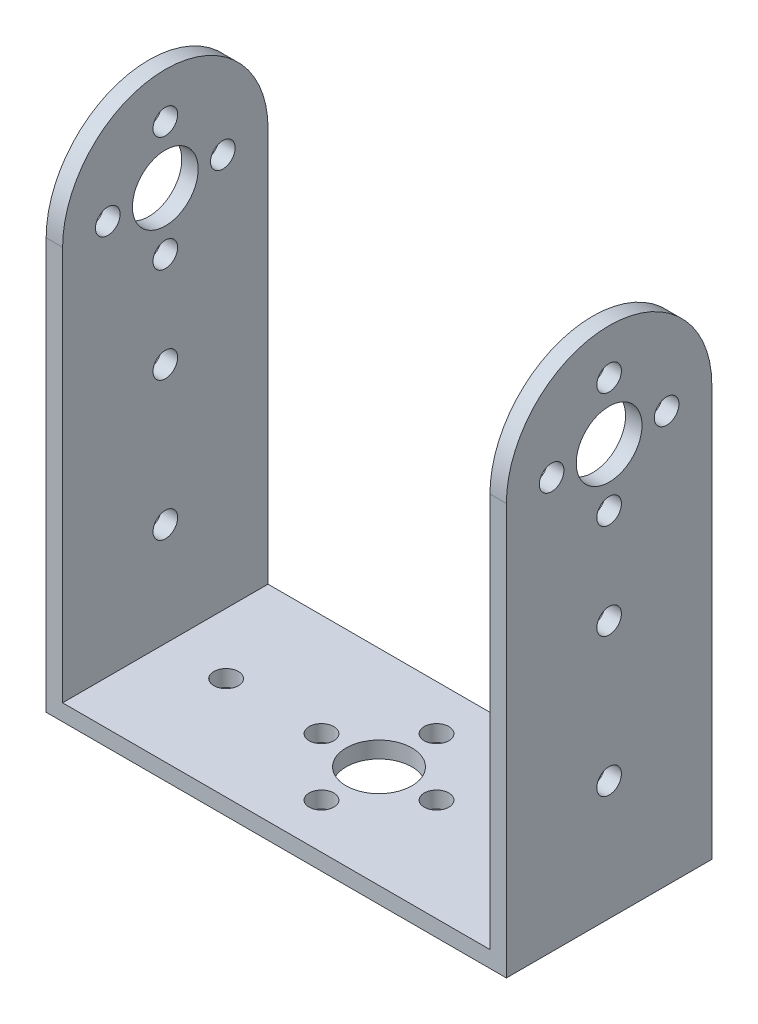
ISO-10303-21;
HEADER;
FILE_DESCRIPTION(('STEP AP214'),'2;1');
FILE_NAME('part.step','',(''),(''),'','','');
FILE_SCHEMA(('AUTOMOTIVE_DESIGN { 1 0 10303 214 1 1 1 1 }'));
ENDSEC;
DATA;
#1=APPLICATION_CONTEXT('core data for automotive mechanical design processes');
#2=APPLICATION_PROTOCOL_DEFINITION('international standard','automotive_design',2000,#1);
#3=PRODUCT_CONTEXT('',#1,'mechanical');
#4=PRODUCT('Part','Part','',(#3));
#5=PRODUCT_RELATED_PRODUCT_CATEGORY('part','',(#4));
#6=PRODUCT_DEFINITION_FORMATION('','',#4);
#7=PRODUCT_DEFINITION_CONTEXT('part definition',#1,'design');
#8=PRODUCT_DEFINITION('design','',#6,#7);
#9=PRODUCT_DEFINITION_SHAPE('','',#8);
#10=(LENGTH_UNIT() NAMED_UNIT(*) SI_UNIT(.MILLI.,.METRE.));
#11=(NAMED_UNIT(*) PLANE_ANGLE_UNIT() SI_UNIT($,.RADIAN.));
#12=(NAMED_UNIT(*) SI_UNIT($,.STERADIAN.) SOLID_ANGLE_UNIT());
#13=UNCERTAINTY_MEASURE_WITH_UNIT(LENGTH_MEASURE(1.E-05),#10,'distance_accuracy_value','');
#14=(GEOMETRIC_REPRESENTATION_CONTEXT(3) GLOBAL_UNCERTAINTY_ASSIGNED_CONTEXT((#13)) GLOBAL_UNIT_ASSIGNED_CONTEXT((#10,
#11,#12)) REPRESENTATION_CONTEXT('',''));
#15=CARTESIAN_POINT('',(0.,0.,0.));
#16=DIRECTION('',(0.,0.,1.));
#17=DIRECTION('',(1.,0.,0.));
#18=AXIS2_PLACEMENT_3D('',#15,#16,#17);
#19=CARTESIAN_POINT('',(0.,2.,0.));
#20=DIRECTION('',(0.,1.,0.));
#21=DIRECTION('',(0.,0.,1.));
#22=AXIS2_PLACEMENT_3D('',#19,#20,#21);
#23=PLANE('',#22);
#24=CARTESIAN_POINT('',(18.6,2.,0.));
#25=DIRECTION('',(0.,1.,0.));
#26=DIRECTION('',(0.,0.,1.));
#27=AXIS2_PLACEMENT_3D('',#24,#25,#26);
#28=CIRCLE('',#27,1.5);
#29=CARTESIAN_POINT('',(18.6,2.,1.5));
#30=VERTEX_POINT('',#29);
#31=EDGE_CURVE('E221',#30,#30,#28,.T.);
#32=ORIENTED_EDGE('',*,*,#31,.F.);
#33=EDGE_LOOP('',(#32));
#34=FACE_BOUND('',#33,.T.);
#35=CARTESIAN_POINT('',(0.,2.,7.));
#36=DIRECTION('',(0.,1.,0.));
#37=DIRECTION('',(0.,0.,1.));
#38=AXIS2_PLACEMENT_3D('',#35,#36,#37);
#39=CIRCLE('',#38,1.5);
#40=CARTESIAN_POINT('',(0.,2.,8.5));
#41=VERTEX_POINT('',#40);
#42=EDGE_CURVE('E233',#41,#41,#39,.T.);
#43=ORIENTED_EDGE('',*,*,#42,.F.);
#44=EDGE_LOOP('',(#43));
#45=FACE_BOUND('',#44,.T.);
#46=CARTESIAN_POINT('',(0.,2.,-7.));
#47=DIRECTION('',(0.,1.,0.));
#48=DIRECTION('',(0.,0.,1.));
#49=AXIS2_PLACEMENT_3D('',#46,#47,#48);
#50=CIRCLE('',#49,1.5);
#51=CARTESIAN_POINT('',(0.,2.,-5.5));
#52=VERTEX_POINT('',#51);
#53=EDGE_CURVE('E245',#52,#52,#50,.T.);
#54=ORIENTED_EDGE('',*,*,#53,.F.);
#55=EDGE_LOOP('',(#54));
#56=FACE_BOUND('',#55,.T.);
#57=DIRECTION('',(0.,0.,1.));
#58=VECTOR('',#57,1.);
#59=CARTESIAN_POINT('',(-26.,2.,12.5));
#60=LINE('',#59,#58);
#61=CARTESIAN_POINT('',(-26.,2.,-12.5));
#62=VERTEX_POINT('',#61);
#63=CARTESIAN_POINT('',(-26.,2.,12.5));
#64=VERTEX_POINT('',#63);
#65=EDGE_CURVE('E38',#62,#64,#60,.T.);
#66=ORIENTED_EDGE('',*,*,#65,.T.);
#67=DIRECTION('',(1.,0.,0.));
#68=VECTOR('',#67,1.);
#69=CARTESIAN_POINT('',(26.,2.,12.5));
#70=LINE('',#69,#68);
#71=CARTESIAN_POINT('',(26.,2.,12.5));
#72=VERTEX_POINT('',#71);
#73=EDGE_CURVE('E260',#64,#72,#70,.T.);
#74=ORIENTED_EDGE('',*,*,#73,.T.);
#75=DIRECTION('',(0.,0.,-1.));
#76=VECTOR('',#75,1.);
#77=CARTESIAN_POINT('',(26.,2.,12.5));
#78=LINE('',#77,#76);
#79=CARTESIAN_POINT('',(26.,2.,-12.5));
#80=VERTEX_POINT('',#79);
#81=EDGE_CURVE('E44',#72,#80,#78,.T.);
#82=ORIENTED_EDGE('',*,*,#81,.T.);
#83=DIRECTION('',(-1.,0.,0.));
#84=VECTOR('',#83,1.);
#85=CARTESIAN_POINT('',(26.,2.,-12.5));
#86=LINE('',#85,#84);
#87=EDGE_CURVE('E11',#80,#62,#86,.T.);
#88=ORIENTED_EDGE('',*,*,#87,.T.);
#89=EDGE_LOOP('',(#66,#74,#82,#88));
#90=FACE_BOUND('',#89,.T.);
#91=CARTESIAN_POINT('',(0.,2.,0.));
#92=DIRECTION('',(0.,1.,0.));
#93=DIRECTION('',(0.,0.,1.));
#94=AXIS2_PLACEMENT_3D('',#91,#92,#93);
#95=CIRCLE('',#94,4.);
#96=CARTESIAN_POINT('',(0.,2.,4.));
#97=VERTEX_POINT('',#96);
#98=EDGE_CURVE('E251',#97,#97,#95,.T.);
#99=ORIENTED_EDGE('',*,*,#98,.F.);
#100=EDGE_LOOP('',(#99));
#101=FACE_BOUND('',#100,.T.);
#102=CARTESIAN_POINT('',(7.,2.,0.));
#103=DIRECTION('',(0.,1.,0.));
#104=DIRECTION('',(0.,0.,1.));
#105=AXIS2_PLACEMENT_3D('',#102,#103,#104);
#106=CIRCLE('',#105,1.5);
#107=CARTESIAN_POINT('',(7.,2.,1.5));
#108=VERTEX_POINT('',#107);
#109=EDGE_CURVE('E239',#108,#108,#106,.T.);
#110=ORIENTED_EDGE('',*,*,#109,.F.);
#111=EDGE_LOOP('',(#110));
#112=FACE_BOUND('',#111,.T.);
#113=CARTESIAN_POINT('',(-7.,2.,0.));
#114=DIRECTION('',(0.,1.,0.));
#115=DIRECTION('',(0.,0.,1.));
#116=AXIS2_PLACEMENT_3D('',#113,#114,#115);
#117=CIRCLE('',#116,1.5);
#118=CARTESIAN_POINT('',(-7.,2.,1.5));
#119=VERTEX_POINT('',#118);
#120=EDGE_CURVE('E227',#119,#119,#117,.T.);
#121=ORIENTED_EDGE('',*,*,#120,.F.);
#122=EDGE_LOOP('',(#121));
#123=FACE_BOUND('',#122,.T.);
#124=CARTESIAN_POINT('',(-18.6,2.,0.));
#125=DIRECTION('',(0.,1.,0.));
#126=DIRECTION('',(0.,0.,1.));
#127=AXIS2_PLACEMENT_3D('',#124,#125,#126);
#128=CIRCLE('',#127,1.5);
#129=CARTESIAN_POINT('',(-18.6,2.,1.5));
#130=VERTEX_POINT('',#129);
#131=EDGE_CURVE('E214',#130,#130,#128,.T.);
#132=ORIENTED_EDGE('',*,*,#131,.F.);
#133=EDGE_LOOP('',(#132));
#134=FACE_BOUND('',#133,.T.);
#135=ADVANCED_FACE('F34',(#34,#45,#56,#90,#101,#112,#123,#134),#23,.T.);
#136=CARTESIAN_POINT('',(0.,0.,0.));
#137=DIRECTION('',(0.,1.,0.));
#138=DIRECTION('',(0.,0.,1.));
#139=AXIS2_PLACEMENT_3D('',#136,#137,#138);
#140=PLANE('',#139);
#141=CARTESIAN_POINT('',(18.6,0.,0.));
#142=DIRECTION('',(0.,1.,0.));
#143=DIRECTION('',(0.,0.,1.));
#144=AXIS2_PLACEMENT_3D('',#141,#142,#143);
#145=CIRCLE('',#144,1.5);
#146=CARTESIAN_POINT('',(18.6,0.,1.5));
#147=VERTEX_POINT('',#146);
#148=EDGE_CURVE('E217',#147,#147,#145,.T.);
#149=ORIENTED_EDGE('',*,*,#148,.T.);
#150=EDGE_LOOP('',(#149));
#151=FACE_BOUND('',#150,.T.);
#152=CARTESIAN_POINT('',(0.,0.,7.));
#153=DIRECTION('',(0.,1.,0.));
#154=DIRECTION('',(0.,0.,1.));
#155=AXIS2_PLACEMENT_3D('',#152,#153,#154);
#156=CIRCLE('',#155,1.5);
#157=CARTESIAN_POINT('',(0.,0.,8.5));
#158=VERTEX_POINT('',#157);
#159=EDGE_CURVE('E230',#158,#158,#156,.T.);
#160=ORIENTED_EDGE('',*,*,#159,.T.);
#161=EDGE_LOOP('',(#160));
#162=FACE_BOUND('',#161,.T.);
#163=CARTESIAN_POINT('',(0.,0.,-7.));
#164=DIRECTION('',(0.,1.,0.));
#165=DIRECTION('',(0.,0.,1.));
#166=AXIS2_PLACEMENT_3D('',#163,#164,#165);
#167=CIRCLE('',#166,1.5);
#168=CARTESIAN_POINT('',(0.,0.,-5.5));
#169=VERTEX_POINT('',#168);
#170=EDGE_CURVE('E242',#169,#169,#167,.T.);
#171=ORIENTED_EDGE('',*,*,#170,.T.);
#172=EDGE_LOOP('',(#171));
#173=FACE_BOUND('',#172,.T.);
#174=DIRECTION('',(1.,0.,0.));
#175=VECTOR('',#174,1.);
#176=CARTESIAN_POINT('',(26.,0.,12.5));
#177=LINE('',#176,#175);
#178=CARTESIAN_POINT('',(-28.,0.,12.5));
#179=VERTEX_POINT('',#178);
#180=CARTESIAN_POINT('',(28.,0.,12.5));
#181=VERTEX_POINT('',#180);
#182=EDGE_CURVE('E113',#179,#181,#177,.T.);
#183=ORIENTED_EDGE('',*,*,#182,.F.);
#184=DIRECTION('',(0.,0.,1.));
#185=VECTOR('',#184,1.);
#186=CARTESIAN_POINT('',(-28.,0.,-12.5));
#187=LINE('',#186,#185);
#188=CARTESIAN_POINT('',(-28.,0.,-12.5));
#189=VERTEX_POINT('',#188);
#190=EDGE_CURVE('E116',#189,#179,#187,.T.);
#191=ORIENTED_EDGE('',*,*,#190,.F.);
#192=DIRECTION('',(-1.,0.,0.));
#193=VECTOR('',#192,1.);
#194=CARTESIAN_POINT('',(26.,0.,-12.5));
#195=LINE('',#194,#193);
#196=CARTESIAN_POINT('',(28.,0.,-12.5));
#197=VERTEX_POINT('',#196);
#198=EDGE_CURVE('E102',#197,#189,#195,.T.);
#199=ORIENTED_EDGE('',*,*,#198,.F.);
#200=DIRECTION('',(0.,0.,-1.));
#201=VECTOR('',#200,1.);
#202=CARTESIAN_POINT('',(28.,0.,12.5));
#203=LINE('',#202,#201);
#204=EDGE_CURVE('E196',#181,#197,#203,.T.);
#205=ORIENTED_EDGE('',*,*,#204,.F.);
#206=EDGE_LOOP('',(#183,#191,#199,#205));
#207=FACE_BOUND('',#206,.T.);
#208=CARTESIAN_POINT('',(0.,0.,0.));
#209=DIRECTION('',(0.,1.,0.));
#210=DIRECTION('',(0.,0.,1.));
#211=AXIS2_PLACEMENT_3D('',#208,#209,#210);
#212=CIRCLE('',#211,4.);
#213=CARTESIAN_POINT('',(0.,0.,4.));
#214=VERTEX_POINT('',#213);
#215=EDGE_CURVE('E248',#214,#214,#212,.T.);
#216=ORIENTED_EDGE('',*,*,#215,.T.);
#217=EDGE_LOOP('',(#216));
#218=FACE_BOUND('',#217,.T.);
#219=CARTESIAN_POINT('',(7.,0.,0.));
#220=DIRECTION('',(0.,1.,0.));
#221=DIRECTION('',(0.,0.,1.));
#222=AXIS2_PLACEMENT_3D('',#219,#220,#221);
#223=CIRCLE('',#222,1.5);
#224=CARTESIAN_POINT('',(7.,0.,1.5));
#225=VERTEX_POINT('',#224);
#226=EDGE_CURVE('E236',#225,#225,#223,.T.);
#227=ORIENTED_EDGE('',*,*,#226,.T.);
#228=EDGE_LOOP('',(#227));
#229=FACE_BOUND('',#228,.T.);
#230=CARTESIAN_POINT('',(-7.,0.,0.));
#231=DIRECTION('',(0.,1.,0.));
#232=DIRECTION('',(0.,0.,1.));
#233=AXIS2_PLACEMENT_3D('',#230,#231,#232);
#234=CIRCLE('',#233,1.5);
#235=CARTESIAN_POINT('',(-7.,0.,1.5));
#236=VERTEX_POINT('',#235);
#237=EDGE_CURVE('E224',#236,#236,#234,.T.);
#238=ORIENTED_EDGE('',*,*,#237,.T.);
#239=EDGE_LOOP('',(#238));
#240=FACE_BOUND('',#239,.T.);
#241=CARTESIAN_POINT('',(-18.6,0.,0.));
#242=DIRECTION('',(0.,1.,0.));
#243=DIRECTION('',(0.,0.,1.));
#244=AXIS2_PLACEMENT_3D('',#241,#242,#243);
#245=CIRCLE('',#244,1.5);
#246=CARTESIAN_POINT('',(-18.6,0.,1.5));
#247=VERTEX_POINT('',#246);
#248=EDGE_CURVE('E218',#247,#247,#245,.T.);
#249=ORIENTED_EDGE('',*,*,#248,.T.);
#250=EDGE_LOOP('',(#249));
#251=FACE_BOUND('',#250,.T.);
#252=ADVANCED_FACE('F117',(#151,#162,#173,#207,#218,#229,#240,#251),#140,.F.);
#253=CARTESIAN_POINT('',(26.,2.,12.5));
#254=DIRECTION('',(0.,0.,-1.));
#255=DIRECTION('',(-1.,0.,0.));
#256=AXIS2_PLACEMENT_3D('',#253,#254,#255);
#257=PLANE('',#256);
#258=ORIENTED_EDGE('',*,*,#182,.T.);
#259=DIRECTION('',(0.,-1.,0.));
#260=VECTOR('',#259,1.);
#261=CARTESIAN_POINT('',(28.,0.,12.5));
#262=LINE('',#261,#260);
#263=CARTESIAN_POINT('',(28.,50.,12.5));
#264=VERTEX_POINT('',#263);
#265=EDGE_CURVE('E193',#264,#181,#262,.T.);
#266=ORIENTED_EDGE('',*,*,#265,.F.);
#267=DIRECTION('',(-1.,0.,0.));
#268=VECTOR('',#267,1.);
#269=CARTESIAN_POINT('',(28.,50.,12.5));
#270=LINE('',#269,#268);
#271=CARTESIAN_POINT('',(26.,50.,12.5));
#272=VERTEX_POINT('',#271);
#273=EDGE_CURVE('E202',#264,#272,#270,.T.);
#274=ORIENTED_EDGE('',*,*,#273,.T.);
#275=DIRECTION('',(0.,-1.,0.));
#276=VECTOR('',#275,1.);
#277=CARTESIAN_POINT('',(26.,0.,12.5));
#278=LINE('',#277,#276);
#279=EDGE_CURVE('E190',#272,#72,#278,.T.);
#280=ORIENTED_EDGE('',*,*,#279,.T.);
#281=ORIENTED_EDGE('',*,*,#73,.F.);
#282=DIRECTION('',(0.,1.,0.));
#283=VECTOR('',#282,1.);
#284=CARTESIAN_POINT('',(-26.,0.,12.5));
#285=LINE('',#284,#283);
#286=CARTESIAN_POINT('',(-26.,50.,12.5));
#287=VERTEX_POINT('',#286);
#288=EDGE_CURVE('E60',#64,#287,#285,.T.);
#289=ORIENTED_EDGE('',*,*,#288,.T.);
#290=DIRECTION('',(1.,0.,0.));
#291=VECTOR('',#290,1.);
#292=CARTESIAN_POINT('',(-28.,50.,12.5));
#293=LINE('',#292,#291);
#294=CARTESIAN_POINT('',(-28.,50.,12.5));
#295=VERTEX_POINT('',#294);
#296=EDGE_CURVE('E147',#295,#287,#293,.T.);
#297=ORIENTED_EDGE('',*,*,#296,.F.);
#298=DIRECTION('',(0.,1.,0.));
#299=VECTOR('',#298,1.);
#300=CARTESIAN_POINT('',(-28.,0.,12.5));
#301=LINE('',#300,#299);
#302=EDGE_CURVE('E121',#179,#295,#301,.T.);
#303=ORIENTED_EDGE('',*,*,#302,.F.);
#304=EDGE_LOOP('',(#258,#266,#274,#280,#281,#289,#297,#303));
#305=FACE_BOUND('',#304,.T.);
#306=ADVANCED_FACE('F36',(#305),#257,.F.);
#307=CARTESIAN_POINT('',(26.,2.,-12.5));
#308=DIRECTION('',(0.,0.,1.));
#309=DIRECTION('',(1.,0.,0.));
#310=AXIS2_PLACEMENT_3D('',#307,#308,#309);
#311=PLANE('',#310);
#312=ORIENTED_EDGE('',*,*,#198,.T.);
#313=DIRECTION('',(0.,-1.,0.));
#314=VECTOR('',#313,1.);
#315=CARTESIAN_POINT('',(-28.,0.,-12.5));
#316=LINE('',#315,#314);
#317=CARTESIAN_POINT('',(-28.,50.,-12.5));
#318=VERTEX_POINT('',#317);
#319=EDGE_CURVE('E107',#318,#189,#316,.T.);
#320=ORIENTED_EDGE('',*,*,#319,.F.);
#321=DIRECTION('',(1.,0.,0.));
#322=VECTOR('',#321,1.);
#323=CARTESIAN_POINT('',(-28.,50.,-12.5));
#324=LINE('',#323,#322);
#325=CARTESIAN_POINT('',(-26.,50.,-12.5));
#326=VERTEX_POINT('',#325);
#327=EDGE_CURVE('E137',#318,#326,#324,.T.);
#328=ORIENTED_EDGE('',*,*,#327,.T.);
#329=DIRECTION('',(0.,-1.,0.));
#330=VECTOR('',#329,1.);
#331=CARTESIAN_POINT('',(-26.,0.,-12.5));
#332=LINE('',#331,#330);
#333=EDGE_CURVE('E142',#326,#62,#332,.T.);
#334=ORIENTED_EDGE('',*,*,#333,.T.);
#335=ORIENTED_EDGE('',*,*,#87,.F.);
#336=DIRECTION('',(0.,1.,0.));
#337=VECTOR('',#336,1.);
#338=CARTESIAN_POINT('',(26.,0.,-12.5));
#339=LINE('',#338,#337);
#340=CARTESIAN_POINT('',(26.,50.,-12.5));
#341=VERTEX_POINT('',#340);
#342=EDGE_CURVE('E52',#80,#341,#339,.T.);
#343=ORIENTED_EDGE('',*,*,#342,.T.);
#344=DIRECTION('',(-1.,0.,0.));
#345=VECTOR('',#344,1.);
#346=CARTESIAN_POINT('',(28.,50.,-12.5));
#347=LINE('',#346,#345);
#348=CARTESIAN_POINT('',(28.,50.,-12.5));
#349=VERTEX_POINT('',#348);
#350=EDGE_CURVE('E211',#349,#341,#347,.T.);
#351=ORIENTED_EDGE('',*,*,#350,.F.);
#352=DIRECTION('',(0.,1.,0.));
#353=VECTOR('',#352,1.);
#354=CARTESIAN_POINT('',(28.,0.,-12.5));
#355=LINE('',#354,#353);
#356=EDGE_CURVE('E109',#197,#349,#355,.T.);
#357=ORIENTED_EDGE('',*,*,#356,.F.);
#358=EDGE_LOOP('',(#312,#320,#328,#334,#335,#343,#351,#357));
#359=FACE_BOUND('',#358,.T.);
#360=ADVANCED_FACE('F104',(#359),#311,.F.);
#361=CARTESIAN_POINT('',(0.,2.,0.));
#362=DIRECTION('',(0.,-1.,0.));
#363=DIRECTION('',(0.,0.,-1.));
#364=AXIS2_PLACEMENT_3D('',#361,#362,#363);
#365=CYLINDRICAL_SURFACE('',#364,4.);
#366=ORIENTED_EDGE('',*,*,#98,.T.);
#367=EDGE_LOOP('',(#366));
#368=FACE_BOUND('',#367,.T.);
#369=ORIENTED_EDGE('',*,*,#215,.F.);
#370=EDGE_LOOP('',(#369));
#371=FACE_BOUND('',#370,.T.);
#372=ADVANCED_FACE('F344',(#368,#371),#365,.F.);
#373=CARTESIAN_POINT('',(0.,2.,-7.));
#374=DIRECTION('',(0.,-1.,0.));
#375=DIRECTION('',(0.,0.,-1.));
#376=AXIS2_PLACEMENT_3D('',#373,#374,#375);
#377=CYLINDRICAL_SURFACE('',#376,1.5);
#378=ORIENTED_EDGE('',*,*,#53,.T.);
#379=EDGE_LOOP('',(#378));
#380=FACE_BOUND('',#379,.T.);
#381=ORIENTED_EDGE('',*,*,#170,.F.);
#382=EDGE_LOOP('',(#381));
#383=FACE_BOUND('',#382,.T.);
#384=ADVANCED_FACE('F351',(#380,#383),#377,.F.);
#385=CARTESIAN_POINT('',(7.,2.,0.));
#386=DIRECTION('',(0.,-1.,0.));
#387=DIRECTION('',(0.,0.,-1.));
#388=AXIS2_PLACEMENT_3D('',#385,#386,#387);
#389=CYLINDRICAL_SURFACE('',#388,1.5);
#390=ORIENTED_EDGE('',*,*,#109,.T.);
#391=EDGE_LOOP('',(#390));
#392=FACE_BOUND('',#391,.T.);
#393=ORIENTED_EDGE('',*,*,#226,.F.);
#394=EDGE_LOOP('',(#393));
#395=FACE_BOUND('',#394,.T.);
#396=ADVANCED_FACE('F481',(#392,#395),#389,.F.);
#397=CARTESIAN_POINT('',(0.,2.,7.));
#398=DIRECTION('',(0.,-1.,0.));
#399=DIRECTION('',(0.,0.,-1.));
#400=AXIS2_PLACEMENT_3D('',#397,#398,#399);
#401=CYLINDRICAL_SURFACE('',#400,1.5);
#402=ORIENTED_EDGE('',*,*,#42,.T.);
#403=EDGE_LOOP('',(#402));
#404=FACE_BOUND('',#403,.T.);
#405=ORIENTED_EDGE('',*,*,#159,.F.);
#406=EDGE_LOOP('',(#405));
#407=FACE_BOUND('',#406,.T.);
#408=ADVANCED_FACE('F471',(#404,#407),#401,.F.);
#409=CARTESIAN_POINT('',(-7.,2.,0.));
#410=DIRECTION('',(0.,-1.,0.));
#411=DIRECTION('',(0.,0.,-1.));
#412=AXIS2_PLACEMENT_3D('',#409,#410,#411);
#413=CYLINDRICAL_SURFACE('',#412,1.5);
#414=ORIENTED_EDGE('',*,*,#120,.T.);
#415=EDGE_LOOP('',(#414));
#416=FACE_BOUND('',#415,.T.);
#417=ORIENTED_EDGE('',*,*,#237,.F.);
#418=EDGE_LOOP('',(#417));
#419=FACE_BOUND('',#418,.T.);
#420=ADVANCED_FACE('F461',(#416,#419),#413,.F.);
#421=CARTESIAN_POINT('',(18.6,2.,0.));
#422=DIRECTION('',(0.,-1.,0.));
#423=DIRECTION('',(0.,0.,-1.));
#424=AXIS2_PLACEMENT_3D('',#421,#422,#423);
#425=CYLINDRICAL_SURFACE('',#424,1.5);
#426=ORIENTED_EDGE('',*,*,#31,.T.);
#427=EDGE_LOOP('',(#426));
#428=FACE_BOUND('',#427,.T.);
#429=ORIENTED_EDGE('',*,*,#148,.F.);
#430=EDGE_LOOP('',(#429));
#431=FACE_BOUND('',#430,.T.);
#432=ADVANCED_FACE('F451',(#428,#431),#425,.F.);
#433=CARTESIAN_POINT('',(-18.6,2.,0.));
#434=DIRECTION('',(0.,-1.,0.));
#435=DIRECTION('',(0.,0.,-1.));
#436=AXIS2_PLACEMENT_3D('',#433,#434,#435);
#437=CYLINDRICAL_SURFACE('',#436,1.5);
#438=ORIENTED_EDGE('',*,*,#131,.T.);
#439=EDGE_LOOP('',(#438));
#440=FACE_BOUND('',#439,.T.);
#441=ORIENTED_EDGE('',*,*,#248,.F.);
#442=EDGE_LOOP('',(#441));
#443=FACE_BOUND('',#442,.T.);
#444=ADVANCED_FACE('F309',(#440,#443),#437,.F.);
#445=CARTESIAN_POINT('',(26.,50.,0.));
#446=DIRECTION('',(-1.,0.,0.));
#447=DIRECTION('',(0.,0.,1.));
#448=AXIS2_PLACEMENT_3D('',#445,#446,#447);
#449=PLANE('',#448);
#450=CARTESIAN_POINT('',(26.,14.53,0.));
#451=DIRECTION('',(1.,0.,0.));
#452=DIRECTION('',(0.,0.,-1.));
#453=AXIS2_PLACEMENT_3D('',#450,#451,#452);
#454=CIRCLE('',#453,1.5);
#455=CARTESIAN_POINT('',(26.,14.53,-1.5));
#456=VERTEX_POINT('',#455);
#457=EDGE_CURVE('E154',#456,#456,#454,.T.);
#458=ORIENTED_EDGE('',*,*,#457,.T.);
#459=EDGE_LOOP('',(#458));
#460=FACE_BOUND('',#459,.T.);
#461=CARTESIAN_POINT('',(26.,50.,7.));
#462=DIRECTION('',(1.,0.,0.));
#463=DIRECTION('',(0.,0.,-1.));
#464=AXIS2_PLACEMENT_3D('',#461,#462,#463);
#465=CIRCLE('',#464,1.5);
#466=CARTESIAN_POINT('',(26.,50.,5.5));
#467=VERTEX_POINT('',#466);
#468=EDGE_CURVE('E160',#467,#467,#465,.T.);
#469=ORIENTED_EDGE('',*,*,#468,.T.);
#470=EDGE_LOOP('',(#469));
#471=FACE_BOUND('',#470,.T.);
#472=CARTESIAN_POINT('',(26.,50.,-7.));
#473=DIRECTION('',(1.,0.,0.));
#474=DIRECTION('',(0.,0.,-1.));
#475=AXIS2_PLACEMENT_3D('',#472,#473,#474);
#476=CIRCLE('',#475,1.5);
#477=CARTESIAN_POINT('',(26.,50.,-8.5));
#478=VERTEX_POINT('',#477);
#479=EDGE_CURVE('E172',#478,#478,#476,.T.);
#480=ORIENTED_EDGE('',*,*,#479,.T.);
#481=EDGE_LOOP('',(#480));
#482=FACE_BOUND('',#481,.T.);
#483=CARTESIAN_POINT('',(26.,50.,0.));
#484=DIRECTION('',(1.,0.,0.));
#485=DIRECTION('',(0.,0.,-1.));
#486=AXIS2_PLACEMENT_3D('',#483,#484,#485);
#487=CIRCLE('',#486,4.);
#488=CARTESIAN_POINT('',(26.,50.,-4.));
#489=VERTEX_POINT('',#488);
#490=EDGE_CURVE('E184',#489,#489,#487,.T.);
#491=ORIENTED_EDGE('',*,*,#490,.T.);
#492=EDGE_LOOP('',(#491));
#493=FACE_BOUND('',#492,.T.);
#494=CARTESIAN_POINT('',(26.,43.,0.));
#495=DIRECTION('',(1.,0.,0.));
#496=DIRECTION('',(0.,0.,-1.));
#497=AXIS2_PLACEMENT_3D('',#494,#495,#496);
#498=CIRCLE('',#497,1.5);
#499=CARTESIAN_POINT('',(26.,43.,-1.5));
#500=VERTEX_POINT('',#499);
#501=EDGE_CURVE('E178',#500,#500,#498,.T.);
#502=ORIENTED_EDGE('',*,*,#501,.T.);
#503=EDGE_LOOP('',(#502));
#504=FACE_BOUND('',#503,.T.);
#505=CARTESIAN_POINT('',(26.,57.,0.));
#506=DIRECTION('',(1.,0.,0.));
#507=DIRECTION('',(0.,0.,-1.));
#508=AXIS2_PLACEMENT_3D('',#505,#506,#507);
#509=CIRCLE('',#508,1.5);
#510=CARTESIAN_POINT('',(26.,57.,-1.5));
#511=VERTEX_POINT('',#510);
#512=EDGE_CURVE('E166',#511,#511,#509,.T.);
#513=ORIENTED_EDGE('',*,*,#512,.T.);
#514=EDGE_LOOP('',(#513));
#515=FACE_BOUND('',#514,.T.);
#516=CARTESIAN_POINT('',(26.,31.4,0.));
#517=DIRECTION('',(1.,0.,0.));
#518=DIRECTION('',(0.,0.,-1.));
#519=AXIS2_PLACEMENT_3D('',#516,#517,#518);
#520=CIRCLE('',#519,1.5);
#521=CARTESIAN_POINT('',(26.,31.4,-1.5));
#522=VERTEX_POINT('',#521);
#523=EDGE_CURVE('E153',#522,#522,#520,.T.);
#524=ORIENTED_EDGE('',*,*,#523,.T.);
#525=EDGE_LOOP('',(#524));
#526=FACE_BOUND('',#525,.T.);
#527=ORIENTED_EDGE('',*,*,#81,.F.);
#528=ORIENTED_EDGE('',*,*,#279,.F.);
#529=CARTESIAN_POINT('',(26.,50.,0.));
#530=DIRECTION('',(1.,0.,0.));
#531=DIRECTION('',(0.,0.,1.));
#532=AXIS2_PLACEMENT_3D('',#529,#530,#531);
#533=CIRCLE('',#532,12.5);
#534=EDGE_CURVE('E197',#341,#272,#533,.T.);
#535=ORIENTED_EDGE('',*,*,#534,.F.);
#536=ORIENTED_EDGE('',*,*,#342,.F.);
#537=EDGE_LOOP('',(#527,#528,#535,#536));
#538=FACE_BOUND('',#537,.T.);
#539=ADVANCED_FACE('F281',(#460,#471,#482,#493,#504,#515,#526,#538),#449,.T.);
#540=CARTESIAN_POINT('',(28.,50.,0.));
#541=DIRECTION('',(-1.,0.,0.));
#542=DIRECTION('',(0.,0.,1.));
#543=AXIS2_PLACEMENT_3D('',#540,#541,#542);
#544=PLANE('',#543);
#545=CARTESIAN_POINT('',(28.,31.4,0.));
#546=DIRECTION('',(1.,0.,0.));
#547=DIRECTION('',(0.,0.,-1.));
#548=AXIS2_PLACEMENT_3D('',#545,#546,#547);
#549=CIRCLE('',#548,1.5);
#550=CARTESIAN_POINT('',(28.,31.4,-1.5));
#551=VERTEX_POINT('',#550);
#552=EDGE_CURVE('E157',#551,#551,#549,.T.);
#553=ORIENTED_EDGE('',*,*,#552,.F.);
#554=EDGE_LOOP('',(#553));
#555=FACE_BOUND('',#554,.T.);
#556=CARTESIAN_POINT('',(28.,57.,0.));
#557=DIRECTION('',(1.,0.,0.));
#558=DIRECTION('',(0.,0.,-1.));
#559=AXIS2_PLACEMENT_3D('',#556,#557,#558);
#560=CIRCLE('',#559,1.5);
#561=CARTESIAN_POINT('',(28.,57.,-1.5));
#562=VERTEX_POINT('',#561);
#563=EDGE_CURVE('E169',#562,#562,#560,.T.);
#564=ORIENTED_EDGE('',*,*,#563,.F.);
#565=EDGE_LOOP('',(#564));
#566=FACE_BOUND('',#565,.T.);
#567=CARTESIAN_POINT('',(28.,43.,0.));
#568=DIRECTION('',(1.,0.,0.));
#569=DIRECTION('',(0.,0.,-1.));
#570=AXIS2_PLACEMENT_3D('',#567,#568,#569);
#571=CIRCLE('',#570,1.5);
#572=CARTESIAN_POINT('',(28.,43.,-1.5));
#573=VERTEX_POINT('',#572);
#574=EDGE_CURVE('E181',#573,#573,#571,.T.);
#575=ORIENTED_EDGE('',*,*,#574,.F.);
#576=EDGE_LOOP('',(#575));
#577=FACE_BOUND('',#576,.T.);
#578=ORIENTED_EDGE('',*,*,#265,.T.);
#579=ORIENTED_EDGE('',*,*,#204,.T.);
#580=ORIENTED_EDGE('',*,*,#356,.T.);
#581=CARTESIAN_POINT('',(28.,50.,0.));
#582=DIRECTION('',(1.,0.,0.));
#583=DIRECTION('',(0.,0.,1.));
#584=AXIS2_PLACEMENT_3D('',#581,#582,#583);
#585=CIRCLE('',#584,12.5);
#586=EDGE_CURVE('E200',#349,#264,#585,.T.);
#587=ORIENTED_EDGE('',*,*,#586,.T.);
#588=EDGE_LOOP('',(#578,#579,#580,#587));
#589=FACE_BOUND('',#588,.T.);
#590=CARTESIAN_POINT('',(28.,50.,0.));
#591=DIRECTION('',(1.,0.,0.));
#592=DIRECTION('',(0.,0.,-1.));
#593=AXIS2_PLACEMENT_3D('',#590,#591,#592);
#594=CIRCLE('',#593,4.);
#595=CARTESIAN_POINT('',(28.,50.,-4.));
#596=VERTEX_POINT('',#595);
#597=EDGE_CURVE('E187',#596,#596,#594,.T.);
#598=ORIENTED_EDGE('',*,*,#597,.F.);
#599=EDGE_LOOP('',(#598));
#600=FACE_BOUND('',#599,.T.);
#601=CARTESIAN_POINT('',(28.,50.,-7.));
#602=DIRECTION('',(1.,0.,0.));
#603=DIRECTION('',(0.,0.,-1.));
#604=AXIS2_PLACEMENT_3D('',#601,#602,#603);
#605=CIRCLE('',#604,1.5);
#606=CARTESIAN_POINT('',(28.,50.,-8.5));
#607=VERTEX_POINT('',#606);
#608=EDGE_CURVE('E175',#607,#607,#605,.T.);
#609=ORIENTED_EDGE('',*,*,#608,.F.);
#610=EDGE_LOOP('',(#609));
#611=FACE_BOUND('',#610,.T.);
#612=CARTESIAN_POINT('',(28.,50.,7.));
#613=DIRECTION('',(1.,0.,0.));
#614=DIRECTION('',(0.,0.,-1.));
#615=AXIS2_PLACEMENT_3D('',#612,#613,#614);
#616=CIRCLE('',#615,1.5);
#617=CARTESIAN_POINT('',(28.,50.,5.5));
#618=VERTEX_POINT('',#617);
#619=EDGE_CURVE('E163',#618,#618,#616,.T.);
#620=ORIENTED_EDGE('',*,*,#619,.F.);
#621=EDGE_LOOP('',(#620));
#622=FACE_BOUND('',#621,.T.);
#623=CARTESIAN_POINT('',(28.,14.53,0.));
#624=DIRECTION('',(1.,0.,0.));
#625=DIRECTION('',(0.,0.,-1.));
#626=AXIS2_PLACEMENT_3D('',#623,#624,#625);
#627=CIRCLE('',#626,1.5);
#628=CARTESIAN_POINT('',(28.,14.53,-1.5));
#629=VERTEX_POINT('',#628);
#630=EDGE_CURVE('E150',#629,#629,#627,.T.);
#631=ORIENTED_EDGE('',*,*,#630,.F.);
#632=EDGE_LOOP('',(#631));
#633=FACE_BOUND('',#632,.T.);
#634=ADVANCED_FACE('F287',(#555,#566,#577,#589,#600,#611,#622,#633),#544,.F.);
#635=CARTESIAN_POINT('',(28.,50.,0.));
#636=DIRECTION('',(-1.,0.,0.));
#637=DIRECTION('',(0.,0.,1.));
#638=AXIS2_PLACEMENT_3D('',#635,#636,#637);
#639=CYLINDRICAL_SURFACE('',#638,12.5);
#640=ORIENTED_EDGE('',*,*,#534,.T.);
#641=ORIENTED_EDGE('',*,*,#273,.F.);
#642=ORIENTED_EDGE('',*,*,#586,.F.);
#643=ORIENTED_EDGE('',*,*,#350,.T.);
#644=EDGE_LOOP('',(#640,#641,#642,#643));
#645=FACE_BOUND('',#644,.T.);
#646=ADVANCED_FACE('F285',(#645),#639,.T.);
#647=CARTESIAN_POINT('',(28.,50.,0.));
#648=DIRECTION('',(-1.,0.,0.));
#649=DIRECTION('',(0.,0.,1.));
#650=AXIS2_PLACEMENT_3D('',#647,#648,#649);
#651=CYLINDRICAL_SURFACE('',#650,4.);
#652=ORIENTED_EDGE('',*,*,#597,.T.);
#653=EDGE_LOOP('',(#652));
#654=FACE_BOUND('',#653,.T.);
#655=ORIENTED_EDGE('',*,*,#490,.F.);
#656=EDGE_LOOP('',(#655));
#657=FACE_BOUND('',#656,.T.);
#658=ADVANCED_FACE('F411',(#654,#657),#651,.F.);
#659=CARTESIAN_POINT('',(28.,43.,0.));
#660=DIRECTION('',(-1.,0.,0.));
#661=DIRECTION('',(0.,0.,1.));
#662=AXIS2_PLACEMENT_3D('',#659,#660,#661);
#663=CYLINDRICAL_SURFACE('',#662,1.5);
#664=ORIENTED_EDGE('',*,*,#574,.T.);
#665=EDGE_LOOP('',(#664));
#666=FACE_BOUND('',#665,.T.);
#667=ORIENTED_EDGE('',*,*,#501,.F.);
#668=EDGE_LOOP('',(#667));
#669=FACE_BOUND('',#668,.T.);
#670=ADVANCED_FACE('F401',(#666,#669),#663,.F.);
#671=CARTESIAN_POINT('',(28.,50.,-7.));
#672=DIRECTION('',(-1.,0.,0.));
#673=DIRECTION('',(0.,0.,1.));
#674=AXIS2_PLACEMENT_3D('',#671,#672,#673);
#675=CYLINDRICAL_SURFACE('',#674,1.5);
#676=ORIENTED_EDGE('',*,*,#608,.T.);
#677=EDGE_LOOP('',(#676));
#678=FACE_BOUND('',#677,.T.);
#679=ORIENTED_EDGE('',*,*,#479,.F.);
#680=EDGE_LOOP('',(#679));
#681=FACE_BOUND('',#680,.T.);
#682=ADVANCED_FACE('F391',(#678,#681),#675,.F.);
#683=CARTESIAN_POINT('',(28.,57.,0.));
#684=DIRECTION('',(-1.,0.,0.));
#685=DIRECTION('',(0.,0.,1.));
#686=AXIS2_PLACEMENT_3D('',#683,#684,#685);
#687=CYLINDRICAL_SURFACE('',#686,1.5);
#688=ORIENTED_EDGE('',*,*,#563,.T.);
#689=EDGE_LOOP('',(#688));
#690=FACE_BOUND('',#689,.T.);
#691=ORIENTED_EDGE('',*,*,#512,.F.);
#692=EDGE_LOOP('',(#691));
#693=FACE_BOUND('',#692,.T.);
#694=ADVANCED_FACE('F330',(#690,#693),#687,.F.);
#695=CARTESIAN_POINT('',(28.,50.,7.));
#696=DIRECTION('',(-1.,0.,0.));
#697=DIRECTION('',(0.,0.,1.));
#698=AXIS2_PLACEMENT_3D('',#695,#696,#697);
#699=CYLINDRICAL_SURFACE('',#698,1.5);
#700=ORIENTED_EDGE('',*,*,#619,.T.);
#701=EDGE_LOOP('',(#700));
#702=FACE_BOUND('',#701,.T.);
#703=ORIENTED_EDGE('',*,*,#468,.F.);
#704=EDGE_LOOP('',(#703));
#705=FACE_BOUND('',#704,.T.);
#706=ADVANCED_FACE('F324',(#702,#705),#699,.F.);
#707=CARTESIAN_POINT('',(28.,31.4,0.));
#708=DIRECTION('',(-1.,0.,0.));
#709=DIRECTION('',(0.,0.,1.));
#710=AXIS2_PLACEMENT_3D('',#707,#708,#709);
#711=CYLINDRICAL_SURFACE('',#710,1.5);
#712=ORIENTED_EDGE('',*,*,#552,.T.);
#713=EDGE_LOOP('',(#712));
#714=FACE_BOUND('',#713,.T.);
#715=ORIENTED_EDGE('',*,*,#523,.F.);
#716=EDGE_LOOP('',(#715));
#717=FACE_BOUND('',#716,.T.);
#718=ADVANCED_FACE('F303',(#714,#717),#711,.F.);
#719=CARTESIAN_POINT('',(28.,14.53,0.));
#720=DIRECTION('',(-1.,0.,0.));
#721=DIRECTION('',(0.,0.,1.));
#722=AXIS2_PLACEMENT_3D('',#719,#720,#721);
#723=CYLINDRICAL_SURFACE('',#722,1.5);
#724=ORIENTED_EDGE('',*,*,#630,.T.);
#725=EDGE_LOOP('',(#724));
#726=FACE_BOUND('',#725,.T.);
#727=ORIENTED_EDGE('',*,*,#457,.F.);
#728=EDGE_LOOP('',(#727));
#729=FACE_BOUND('',#728,.T.);
#730=ADVANCED_FACE('F300',(#726,#729),#723,.F.);
#731=CARTESIAN_POINT('',(-26.,50.,0.));
#732=DIRECTION('',(1.,0.,0.));
#733=DIRECTION('',(0.,0.,-1.));
#734=AXIS2_PLACEMENT_3D('',#731,#732,#733);
#735=PLANE('',#734);
#736=CARTESIAN_POINT('',(-26.,14.53,0.));
#737=DIRECTION('',(-1.,0.,0.));
#738=DIRECTION('',(0.,0.,1.));
#739=AXIS2_PLACEMENT_3D('',#736,#737,#738);
#740=CIRCLE('',#739,1.5);
#741=CARTESIAN_POINT('',(-26.,14.53,1.5));
#742=VERTEX_POINT('',#741);
#743=EDGE_CURVE('E631',#742,#742,#740,.T.);
#744=ORIENTED_EDGE('',*,*,#743,.T.);
#745=EDGE_LOOP('',(#744));
#746=FACE_BOUND('',#745,.T.);
#747=CARTESIAN_POINT('',(-26.,43.,0.));
#748=DIRECTION('',(-1.,0.,0.));
#749=DIRECTION('',(0.,0.,1.));
#750=AXIS2_PLACEMENT_3D('',#747,#748,#749);
#751=CIRCLE('',#750,1.5);
#752=CARTESIAN_POINT('',(-26.,43.,1.5));
#753=VERTEX_POINT('',#752);
#754=EDGE_CURVE('E639',#753,#753,#751,.T.);
#755=ORIENTED_EDGE('',*,*,#754,.T.);
#756=EDGE_LOOP('',(#755));
#757=FACE_BOUND('',#756,.T.);
#758=CARTESIAN_POINT('',(-26.,50.,7.));
#759=DIRECTION('',(-1.,0.,0.));
#760=DIRECTION('',(0.,0.,1.));
#761=AXIS2_PLACEMENT_3D('',#758,#759,#760);
#762=CIRCLE('',#761,1.5);
#763=CARTESIAN_POINT('',(-26.,50.,8.5));
#764=VERTEX_POINT('',#763);
#765=EDGE_CURVE('E651',#764,#764,#762,.T.);
#766=ORIENTED_EDGE('',*,*,#765,.T.);
#767=EDGE_LOOP('',(#766));
#768=FACE_BOUND('',#767,.T.);
#769=CARTESIAN_POINT('',(-26.,50.,0.));
#770=DIRECTION('',(-1.,0.,0.));
#771=DIRECTION('',(0.,0.,1.));
#772=AXIS2_PLACEMENT_3D('',#769,#770,#771);
#773=CIRCLE('',#772,4.);
#774=CARTESIAN_POINT('',(-26.,50.,4.));
#775=VERTEX_POINT('',#774);
#776=EDGE_CURVE('E132',#775,#775,#773,.T.);
#777=ORIENTED_EDGE('',*,*,#776,.T.);
#778=EDGE_LOOP('',(#777));
#779=FACE_BOUND('',#778,.T.);
#780=CARTESIAN_POINT('',(-26.,57.,0.));
#781=DIRECTION('',(-1.,0.,0.));
#782=DIRECTION('',(0.,0.,1.));
#783=AXIS2_PLACEMENT_3D('',#780,#781,#782);
#784=CIRCLE('',#783,1.5);
#785=CARTESIAN_POINT('',(-26.,57.,1.5));
#786=VERTEX_POINT('',#785);
#787=EDGE_CURVE('E657',#786,#786,#784,.T.);
#788=ORIENTED_EDGE('',*,*,#787,.T.);
#789=EDGE_LOOP('',(#788));
#790=FACE_BOUND('',#789,.T.);
#791=CARTESIAN_POINT('',(-26.,50.,-7.));
#792=DIRECTION('',(-1.,0.,0.));
#793=DIRECTION('',(0.,0.,1.));
#794=AXIS2_PLACEMENT_3D('',#791,#792,#793);
#795=CIRCLE('',#794,1.5);
#796=CARTESIAN_POINT('',(-26.,50.,-5.50000000000001));
#797=VERTEX_POINT('',#796);
#798=EDGE_CURVE('E645',#797,#797,#795,.T.);
#799=ORIENTED_EDGE('',*,*,#798,.T.);
#800=EDGE_LOOP('',(#799));
#801=FACE_BOUND('',#800,.T.);
#802=CARTESIAN_POINT('',(-26.,31.4,0.));
#803=DIRECTION('',(-1.,0.,0.));
#804=DIRECTION('',(0.,0.,1.));
#805=AXIS2_PLACEMENT_3D('',#802,#803,#804);
#806=CIRCLE('',#805,1.5);
#807=CARTESIAN_POINT('',(-26.,31.4,1.5));
#808=VERTEX_POINT('',#807);
#809=EDGE_CURVE('E633',#808,#808,#806,.T.);
#810=ORIENTED_EDGE('',*,*,#809,.T.);
#811=EDGE_LOOP('',(#810));
#812=FACE_BOUND('',#811,.T.);
#813=ORIENTED_EDGE('',*,*,#65,.F.);
#814=ORIENTED_EDGE('',*,*,#333,.F.);
#815=CARTESIAN_POINT('',(-26.,50.,0.));
#816=DIRECTION('',(-1.,0.,0.));
#817=DIRECTION('',(0.,0.,-1.));
#818=AXIS2_PLACEMENT_3D('',#815,#816,#817);
#819=CIRCLE('',#818,12.5);
#820=EDGE_CURVE('E128',#287,#326,#819,.T.);
#821=ORIENTED_EDGE('',*,*,#820,.F.);
#822=ORIENTED_EDGE('',*,*,#288,.F.);
#823=EDGE_LOOP('',(#813,#814,#821,#822));
#824=FACE_BOUND('',#823,.T.);
#825=ADVANCED_FACE('F271',(#746,#757,#768,#779,#790,#801,#812,#824),#735,.T.);
#826=CARTESIAN_POINT('',(-28.,50.,0.));
#827=DIRECTION('',(1.,0.,0.));
#828=DIRECTION('',(0.,0.,-1.));
#829=AXIS2_PLACEMENT_3D('',#826,#827,#828);
#830=PLANE('',#829);
#831=CARTESIAN_POINT('',(-28.,31.4,0.));
#832=DIRECTION('',(-1.,0.,0.));
#833=DIRECTION('',(0.,0.,1.));
#834=AXIS2_PLACEMENT_3D('',#831,#832,#833);
#835=CIRCLE('',#834,1.5);
#836=CARTESIAN_POINT('',(-28.,31.4,1.5));
#837=VERTEX_POINT('',#836);
#838=EDGE_CURVE('E636',#837,#837,#835,.T.);
#839=ORIENTED_EDGE('',*,*,#838,.F.);
#840=EDGE_LOOP('',(#839));
#841=FACE_BOUND('',#840,.T.);
#842=CARTESIAN_POINT('',(-28.,50.,-7.));
#843=DIRECTION('',(-1.,0.,0.));
#844=DIRECTION('',(0.,0.,1.));
#845=AXIS2_PLACEMENT_3D('',#842,#843,#844);
#846=CIRCLE('',#845,1.5);
#847=CARTESIAN_POINT('',(-28.,50.,-5.50000000000001));
#848=VERTEX_POINT('',#847);
#849=EDGE_CURVE('E648',#848,#848,#846,.T.);
#850=ORIENTED_EDGE('',*,*,#849,.F.);
#851=EDGE_LOOP('',(#850));
#852=FACE_BOUND('',#851,.T.);
#853=CARTESIAN_POINT('',(-28.,57.,0.));
#854=DIRECTION('',(-1.,0.,0.));
#855=DIRECTION('',(0.,0.,1.));
#856=AXIS2_PLACEMENT_3D('',#853,#854,#855);
#857=CIRCLE('',#856,1.5);
#858=CARTESIAN_POINT('',(-28.,57.,1.5));
#859=VERTEX_POINT('',#858);
#860=EDGE_CURVE('E660',#859,#859,#857,.T.);
#861=ORIENTED_EDGE('',*,*,#860,.F.);
#862=EDGE_LOOP('',(#861));
#863=FACE_BOUND('',#862,.T.);
#864=ORIENTED_EDGE('',*,*,#319,.T.);
#865=ORIENTED_EDGE('',*,*,#190,.T.);
#866=ORIENTED_EDGE('',*,*,#302,.T.);
#867=CARTESIAN_POINT('',(-28.,50.,0.));
#868=DIRECTION('',(-1.,0.,0.));
#869=DIRECTION('',(0.,0.,-1.));
#870=AXIS2_PLACEMENT_3D('',#867,#868,#869);
#871=CIRCLE('',#870,12.5);
#872=EDGE_CURVE('E126',#295,#318,#871,.T.);
#873=ORIENTED_EDGE('',*,*,#872,.T.);
#874=EDGE_LOOP('',(#864,#865,#866,#873));
#875=FACE_BOUND('',#874,.T.);
#876=CARTESIAN_POINT('',(-28.,50.,0.));
#877=DIRECTION('',(-1.,0.,0.));
#878=DIRECTION('',(0.,0.,1.));
#879=AXIS2_PLACEMENT_3D('',#876,#877,#878);
#880=CIRCLE('',#879,4.);
#881=CARTESIAN_POINT('',(-28.,50.,4.));
#882=VERTEX_POINT('',#881);
#883=EDGE_CURVE('E146',#882,#882,#880,.T.);
#884=ORIENTED_EDGE('',*,*,#883,.F.);
#885=EDGE_LOOP('',(#884));
#886=FACE_BOUND('',#885,.T.);
#887=CARTESIAN_POINT('',(-28.,50.,7.));
#888=DIRECTION('',(-1.,0.,0.));
#889=DIRECTION('',(0.,0.,1.));
#890=AXIS2_PLACEMENT_3D('',#887,#888,#889);
#891=CIRCLE('',#890,1.5);
#892=CARTESIAN_POINT('',(-28.,50.,8.5));
#893=VERTEX_POINT('',#892);
#894=EDGE_CURVE('E654',#893,#893,#891,.T.);
#895=ORIENTED_EDGE('',*,*,#894,.F.);
#896=EDGE_LOOP('',(#895));
#897=FACE_BOUND('',#896,.T.);
#898=CARTESIAN_POINT('',(-28.,43.,0.));
#899=DIRECTION('',(-1.,0.,0.));
#900=DIRECTION('',(0.,0.,1.));
#901=AXIS2_PLACEMENT_3D('',#898,#899,#900);
#902=CIRCLE('',#901,1.5);
#903=CARTESIAN_POINT('',(-28.,43.,1.5));
#904=VERTEX_POINT('',#903);
#905=EDGE_CURVE('E642',#904,#904,#902,.T.);
#906=ORIENTED_EDGE('',*,*,#905,.F.);
#907=EDGE_LOOP('',(#906));
#908=FACE_BOUND('',#907,.T.);
#909=CARTESIAN_POINT('',(-28.,14.53,0.));
#910=DIRECTION('',(-1.,0.,0.));
#911=DIRECTION('',(0.,0.,1.));
#912=AXIS2_PLACEMENT_3D('',#909,#910,#911);
#913=CIRCLE('',#912,1.5);
#914=CARTESIAN_POINT('',(-28.,14.53,1.5));
#915=VERTEX_POINT('',#914);
#916=EDGE_CURVE('E628',#915,#915,#913,.T.);
#917=ORIENTED_EDGE('',*,*,#916,.F.);
#918=EDGE_LOOP('',(#917));
#919=FACE_BOUND('',#918,.T.);
#920=ADVANCED_FACE('F123',(#841,#852,#863,#875,#886,#897,#908,#919),#830,.F.);
#921=CARTESIAN_POINT('',(-28.,50.,0.));
#922=DIRECTION('',(1.,0.,0.));
#923=DIRECTION('',(0.,0.,-1.));
#924=AXIS2_PLACEMENT_3D('',#921,#922,#923);
#925=CYLINDRICAL_SURFACE('',#924,12.5);
#926=ORIENTED_EDGE('',*,*,#820,.T.);
#927=ORIENTED_EDGE('',*,*,#327,.F.);
#928=ORIENTED_EDGE('',*,*,#872,.F.);
#929=ORIENTED_EDGE('',*,*,#296,.T.);
#930=EDGE_LOOP('',(#926,#927,#928,#929));
#931=FACE_BOUND('',#930,.T.);
#932=ADVANCED_FACE('F275',(#931),#925,.T.);
#933=CARTESIAN_POINT('',(-28.,50.,0.));
#934=DIRECTION('',(1.,0.,0.));
#935=DIRECTION('',(0.,0.,-1.));
#936=AXIS2_PLACEMENT_3D('',#933,#934,#935);
#937=CYLINDRICAL_SURFACE('',#936,4.);
#938=ORIENTED_EDGE('',*,*,#883,.T.);
#939=EDGE_LOOP('',(#938));
#940=FACE_BOUND('',#939,.T.);
#941=ORIENTED_EDGE('',*,*,#776,.F.);
#942=EDGE_LOOP('',(#941));
#943=FACE_BOUND('',#942,.T.);
#944=ADVANCED_FACE('F551',(#940,#943),#937,.F.);
#945=CARTESIAN_POINT('',(-28.,57.,0.));
#946=DIRECTION('',(1.,0.,0.));
#947=DIRECTION('',(0.,0.,-1.));
#948=AXIS2_PLACEMENT_3D('',#945,#946,#947);
#949=CYLINDRICAL_SURFACE('',#948,1.5);
#950=ORIENTED_EDGE('',*,*,#860,.T.);
#951=EDGE_LOOP('',(#950));
#952=FACE_BOUND('',#951,.T.);
#953=ORIENTED_EDGE('',*,*,#787,.F.);
#954=EDGE_LOOP('',(#953));
#955=FACE_BOUND('',#954,.T.);
#956=ADVANCED_FACE('F559',(#952,#955),#949,.F.);
#957=CARTESIAN_POINT('',(-28.,50.,7.));
#958=DIRECTION('',(1.,0.,0.));
#959=DIRECTION('',(0.,0.,-1.));
#960=AXIS2_PLACEMENT_3D('',#957,#958,#959);
#961=CYLINDRICAL_SURFACE('',#960,1.5);
#962=ORIENTED_EDGE('',*,*,#894,.T.);
#963=EDGE_LOOP('',(#962));
#964=FACE_BOUND('',#963,.T.);
#965=ORIENTED_EDGE('',*,*,#765,.F.);
#966=EDGE_LOOP('',(#965));
#967=FACE_BOUND('',#966,.T.);
#968=ADVANCED_FACE('F568',(#964,#967),#961,.F.);
#969=CARTESIAN_POINT('',(-28.,50.,-7.));
#970=DIRECTION('',(1.,0.,0.));
#971=DIRECTION('',(0.,0.,-1.));
#972=AXIS2_PLACEMENT_3D('',#969,#970,#971);
#973=CYLINDRICAL_SURFACE('',#972,1.5);
#974=ORIENTED_EDGE('',*,*,#849,.T.);
#975=EDGE_LOOP('',(#974));
#976=FACE_BOUND('',#975,.T.);
#977=ORIENTED_EDGE('',*,*,#798,.F.);
#978=EDGE_LOOP('',(#977));
#979=FACE_BOUND('',#978,.T.);
#980=ADVANCED_FACE('F577',(#976,#979),#973,.F.);
#981=CARTESIAN_POINT('',(-28.,43.,0.));
#982=DIRECTION('',(1.,0.,0.));
#983=DIRECTION('',(0.,0.,-1.));
#984=AXIS2_PLACEMENT_3D('',#981,#982,#983);
#985=CYLINDRICAL_SURFACE('',#984,1.5);
#986=ORIENTED_EDGE('',*,*,#905,.T.);
#987=EDGE_LOOP('',(#986));
#988=FACE_BOUND('',#987,.T.);
#989=ORIENTED_EDGE('',*,*,#754,.F.);
#990=EDGE_LOOP('',(#989));
#991=FACE_BOUND('',#990,.T.);
#992=ADVANCED_FACE('F586',(#988,#991),#985,.F.);
#993=CARTESIAN_POINT('',(-28.,31.4,0.));
#994=DIRECTION('',(1.,0.,0.));
#995=DIRECTION('',(0.,0.,-1.));
#996=AXIS2_PLACEMENT_3D('',#993,#994,#995);
#997=CYLINDRICAL_SURFACE('',#996,1.5);
#998=ORIENTED_EDGE('',*,*,#838,.T.);
#999=EDGE_LOOP('',(#998));
#1000=FACE_BOUND('',#999,.T.);
#1001=ORIENTED_EDGE('',*,*,#809,.F.);
#1002=EDGE_LOOP('',(#1001));
#1003=FACE_BOUND('',#1002,.T.);
#1004=ADVANCED_FACE('F595',(#1000,#1003),#997,.F.);
#1005=CARTESIAN_POINT('',(-28.,14.53,0.));
#1006=DIRECTION('',(1.,0.,0.));
#1007=DIRECTION('',(0.,0.,-1.));
#1008=AXIS2_PLACEMENT_3D('',#1005,#1006,#1007);
#1009=CYLINDRICAL_SURFACE('',#1008,1.5);
#1010=ORIENTED_EDGE('',*,*,#916,.T.);
#1011=EDGE_LOOP('',(#1010));
#1012=FACE_BOUND('',#1011,.T.);
#1013=ORIENTED_EDGE('',*,*,#743,.F.);
#1014=EDGE_LOOP('',(#1013));
#1015=FACE_BOUND('',#1014,.T.);
#1016=ADVANCED_FACE('F604',(#1012,#1015),#1009,.F.);
#1017=CLOSED_SHELL('',(#135,#252,#306,#360,#372,#384,#396,#408,#420,#432,#444,#539,#634,#646,
#658,#670,#682,#694,#706,#718,#730,#825,#920,#932,#944,#956,#968,#980,#992,#1004,#1016));
#1018=MANIFOLD_SOLID_BREP('B2',#1017);
#1019=ADVANCED_BREP_SHAPE_REPRESENTATION('',(#18,#1018),#14);
#1020=SHAPE_DEFINITION_REPRESENTATION(#9,#1019);
ENDSEC;
END-ISO-10303-21;
